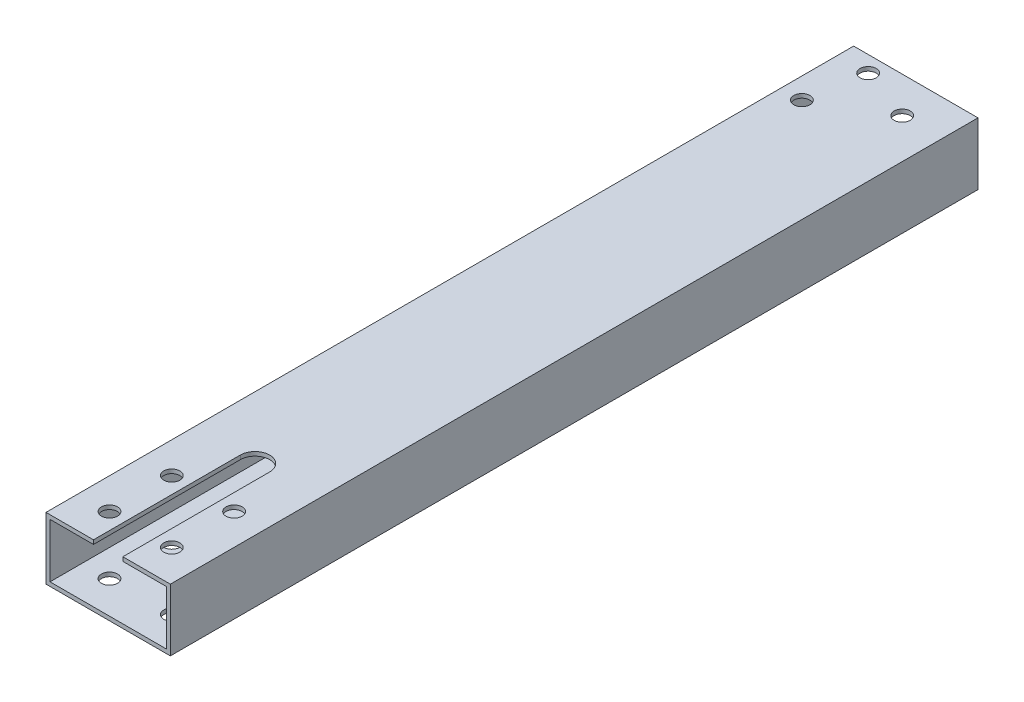
ISO-10303-21;
HEADER;
FILE_DESCRIPTION(('STEP AP214'),'2;1');
FILE_NAME('part.step','',(''),(''),'','','');
FILE_SCHEMA(('AUTOMOTIVE_DESIGN { 1 0 10303 214 1 1 1 1 }'));
ENDSEC;
DATA;
#1=APPLICATION_CONTEXT('core data for automotive mechanical design processes');
#2=APPLICATION_PROTOCOL_DEFINITION('international standard','automotive_design',2000,#1);
#3=PRODUCT_CONTEXT('',#1,'mechanical');
#4=PRODUCT('Part','Part','',(#3));
#5=PRODUCT_RELATED_PRODUCT_CATEGORY('part','',(#4));
#6=PRODUCT_DEFINITION_FORMATION('','',#4);
#7=PRODUCT_DEFINITION_CONTEXT('part definition',#1,'design');
#8=PRODUCT_DEFINITION('design','',#6,#7);
#9=PRODUCT_DEFINITION_SHAPE('','',#8);
#10=(LENGTH_UNIT() NAMED_UNIT(*) SI_UNIT(.MILLI.,.METRE.));
#11=(NAMED_UNIT(*) PLANE_ANGLE_UNIT() SI_UNIT($,.RADIAN.));
#12=(NAMED_UNIT(*) SI_UNIT($,.STERADIAN.) SOLID_ANGLE_UNIT());
#13=UNCERTAINTY_MEASURE_WITH_UNIT(LENGTH_MEASURE(1.E-05),#10,'distance_accuracy_value','');
#14=(GEOMETRIC_REPRESENTATION_CONTEXT(3) GLOBAL_UNCERTAINTY_ASSIGNED_CONTEXT((#13)) GLOBAL_UNIT_ASSIGNED_CONTEXT((#10,
#11,#12)) REPRESENTATION_CONTEXT('',''));
#15=CARTESIAN_POINT('',(0.,0.,0.));
#16=DIRECTION('',(0.,0.,1.));
#17=DIRECTION('',(1.,0.,0.));
#18=AXIS2_PLACEMENT_3D('',#15,#16,#17);
#19=CARTESIAN_POINT('',(0.,0.,330.));
#20=DIRECTION('',(0.,0.,1.));
#21=DIRECTION('',(1.,0.,0.));
#22=AXIS2_PLACEMENT_3D('',#19,#20,#21);
#23=PLANE('',#22);
#24=DIRECTION('',(0.,1.,0.));
#25=VECTOR('',#24,1.);
#26=CARTESIAN_POINT('',(-5.99999999999999,-12.701,330.));
#27=LINE('',#26,#25);
#28=CARTESIAN_POINT('',(-5.99999999999999,11.049,330.));
#29=VERTEX_POINT('',#28);
#30=CARTESIAN_POINT('',(-5.99999999999999,12.7,330.));
#31=VERTEX_POINT('',#30);
#32=EDGE_CURVE('E152',#29,#31,#27,.T.);
#33=ORIENTED_EDGE('',*,*,#32,.T.);
#34=DIRECTION('',(-1.,0.,0.));
#35=VECTOR('',#34,1.);
#36=CARTESIAN_POINT('',(-25.4,12.7,330.));
#37=LINE('',#36,#35);
#38=CARTESIAN_POINT('',(-25.4,12.7,330.));
#39=VERTEX_POINT('',#38);
#40=EDGE_CURVE('E194',#31,#39,#37,.T.);
#41=ORIENTED_EDGE('',*,*,#40,.T.);
#42=DIRECTION('',(0.,-1.,0.));
#43=VECTOR('',#42,1.);
#44=CARTESIAN_POINT('',(-25.4,12.7,330.));
#45=LINE('',#44,#43);
#46=CARTESIAN_POINT('',(-25.4,-12.7,330.));
#47=VERTEX_POINT('',#46);
#48=EDGE_CURVE('E186',#39,#47,#45,.T.);
#49=ORIENTED_EDGE('',*,*,#48,.T.);
#50=DIRECTION('',(1.,0.,0.));
#51=VECTOR('',#50,1.);
#52=CARTESIAN_POINT('',(-25.4,-12.7,330.));
#53=LINE('',#52,#51);
#54=CARTESIAN_POINT('',(25.4,-12.7,330.));
#55=VERTEX_POINT('',#54);
#56=EDGE_CURVE('E189',#47,#55,#53,.T.);
#57=ORIENTED_EDGE('',*,*,#56,.T.);
#58=DIRECTION('',(0.,1.,0.));
#59=VECTOR('',#58,1.);
#60=CARTESIAN_POINT('',(25.4,12.7,330.));
#61=LINE('',#60,#59);
#62=CARTESIAN_POINT('',(25.4,12.7,330.));
#63=VERTEX_POINT('',#62);
#64=EDGE_CURVE('E192',#55,#63,#61,.T.);
#65=ORIENTED_EDGE('',*,*,#64,.T.);
#66=CARTESIAN_POINT('',(6.00000000000001,12.7,330.));
#67=VERTEX_POINT('',#66);
#68=EDGE_CURVE('E151',#63,#67,#37,.T.);
#69=ORIENTED_EDGE('',*,*,#68,.T.);
#70=DIRECTION('',(0.,1.,0.));
#71=VECTOR('',#70,1.);
#72=CARTESIAN_POINT('',(6.00000000000001,-12.701,330.));
#73=LINE('',#72,#71);
#74=CARTESIAN_POINT('',(6.00000000000001,11.049,330.));
#75=VERTEX_POINT('',#74);
#76=EDGE_CURVE('E137',#75,#67,#73,.T.);
#77=ORIENTED_EDGE('',*,*,#76,.F.);
#78=DIRECTION('',(-1.,0.,0.));
#79=VECTOR('',#78,1.);
#80=CARTESIAN_POINT('',(-23.749,11.049,330.));
#81=LINE('',#80,#79);
#82=CARTESIAN_POINT('',(23.749,11.049,330.));
#83=VERTEX_POINT('',#82);
#84=EDGE_CURVE('E149',#83,#75,#81,.T.);
#85=ORIENTED_EDGE('',*,*,#84,.F.);
#86=DIRECTION('',(0.,1.,0.));
#87=VECTOR('',#86,1.);
#88=CARTESIAN_POINT('',(23.749,11.049,330.));
#89=LINE('',#88,#87);
#90=CARTESIAN_POINT('',(23.749,-11.049,330.));
#91=VERTEX_POINT('',#90);
#92=EDGE_CURVE('E161',#91,#83,#89,.T.);
#93=ORIENTED_EDGE('',*,*,#92,.F.);
#94=DIRECTION('',(1.,0.,0.));
#95=VECTOR('',#94,1.);
#96=CARTESIAN_POINT('',(-23.749,-11.049,330.));
#97=LINE('',#96,#95);
#98=CARTESIAN_POINT('',(-23.749,-11.049,330.));
#99=VERTEX_POINT('',#98);
#100=EDGE_CURVE('E301',#99,#91,#97,.T.);
#101=ORIENTED_EDGE('',*,*,#100,.F.);
#102=DIRECTION('',(0.,-1.,0.));
#103=VECTOR('',#102,1.);
#104=CARTESIAN_POINT('',(-23.749,11.049,330.));
#105=LINE('',#104,#103);
#106=CARTESIAN_POINT('',(-23.749,11.049,330.));
#107=VERTEX_POINT('',#106);
#108=EDGE_CURVE('E177',#107,#99,#105,.T.);
#109=ORIENTED_EDGE('',*,*,#108,.F.);
#110=EDGE_CURVE('E157',#29,#107,#81,.T.);
#111=ORIENTED_EDGE('',*,*,#110,.F.);
#112=EDGE_LOOP('',(#33,#41,#49,#57,#65,#69,#77,#85,#93,#101,#109,#111));
#113=FACE_BOUND('',#112,.T.);
#114=ADVANCED_FACE('F41',(#113),#23,.T.);
#115=CARTESIAN_POINT('',(0.,0.,0.));
#116=DIRECTION('',(0.,0.,1.));
#117=DIRECTION('',(1.,0.,0.));
#118=AXIS2_PLACEMENT_3D('',#115,#116,#117);
#119=PLANE('',#118);
#120=DIRECTION('',(0.,-1.,0.));
#121=VECTOR('',#120,1.);
#122=CARTESIAN_POINT('',(-25.4,12.7,0.));
#123=LINE('',#122,#121);
#124=CARTESIAN_POINT('',(-25.4,12.7,0.));
#125=VERTEX_POINT('',#124);
#126=CARTESIAN_POINT('',(-25.4,-12.7,0.));
#127=VERTEX_POINT('',#126);
#128=EDGE_CURVE('E185',#125,#127,#123,.T.);
#129=ORIENTED_EDGE('',*,*,#128,.F.);
#130=DIRECTION('',(-1.,0.,0.));
#131=VECTOR('',#130,1.);
#132=CARTESIAN_POINT('',(-25.4,12.7,0.));
#133=LINE('',#132,#131);
#134=CARTESIAN_POINT('',(25.4,12.7,0.));
#135=VERTEX_POINT('',#134);
#136=EDGE_CURVE('E190',#135,#125,#133,.T.);
#137=ORIENTED_EDGE('',*,*,#136,.F.);
#138=DIRECTION('',(0.,1.,0.));
#139=VECTOR('',#138,1.);
#140=CARTESIAN_POINT('',(25.4,12.7,0.));
#141=LINE('',#140,#139);
#142=CARTESIAN_POINT('',(25.4,-12.7,0.));
#143=VERTEX_POINT('',#142);
#144=EDGE_CURVE('E201',#143,#135,#141,.T.);
#145=ORIENTED_EDGE('',*,*,#144,.F.);
#146=DIRECTION('',(1.,0.,0.));
#147=VECTOR('',#146,1.);
#148=CARTESIAN_POINT('',(-25.4,-12.7,0.));
#149=LINE('',#148,#147);
#150=EDGE_CURVE('E199',#127,#143,#149,.T.);
#151=ORIENTED_EDGE('',*,*,#150,.F.);
#152=EDGE_LOOP('',(#129,#137,#145,#151));
#153=FACE_BOUND('',#152,.T.);
#154=DIRECTION('',(0.,-1.,0.));
#155=VECTOR('',#154,1.);
#156=CARTESIAN_POINT('',(-23.749,11.049,0.));
#157=LINE('',#156,#155);
#158=CARTESIAN_POINT('',(-23.749,11.049,0.));
#159=VERTEX_POINT('',#158);
#160=CARTESIAN_POINT('',(-23.749,-11.049,0.));
#161=VERTEX_POINT('',#160);
#162=EDGE_CURVE('E165',#159,#161,#157,.T.);
#163=ORIENTED_EDGE('',*,*,#162,.T.);
#164=DIRECTION('',(1.,0.,0.));
#165=VECTOR('',#164,1.);
#166=CARTESIAN_POINT('',(-23.749,-11.049,0.));
#167=LINE('',#166,#165);
#168=CARTESIAN_POINT('',(23.749,-11.049,0.));
#169=VERTEX_POINT('',#168);
#170=EDGE_CURVE('E168',#161,#169,#167,.T.);
#171=ORIENTED_EDGE('',*,*,#170,.T.);
#172=DIRECTION('',(0.,1.,0.));
#173=VECTOR('',#172,1.);
#174=CARTESIAN_POINT('',(23.749,11.049,0.));
#175=LINE('',#174,#173);
#176=CARTESIAN_POINT('',(23.749,11.049,0.));
#177=VERTEX_POINT('',#176);
#178=EDGE_CURVE('E172',#169,#177,#175,.T.);
#179=ORIENTED_EDGE('',*,*,#178,.T.);
#180=DIRECTION('',(-1.,0.,0.));
#181=VECTOR('',#180,1.);
#182=CARTESIAN_POINT('',(-23.749,11.049,0.));
#183=LINE('',#182,#181);
#184=EDGE_CURVE('E175',#177,#159,#183,.T.);
#185=ORIENTED_EDGE('',*,*,#184,.T.);
#186=EDGE_LOOP('',(#163,#171,#179,#185));
#187=FACE_BOUND('',#186,.T.);
#188=ADVANCED_FACE('F316',(#153,#187),#119,.F.);
#189=CARTESIAN_POINT('',(-25.4,12.7,330.));
#190=DIRECTION('',(1.,0.,0.));
#191=DIRECTION('',(0.,0.,-1.));
#192=AXIS2_PLACEMENT_3D('',#189,#190,#191);
#193=PLANE('',#192);
#194=ORIENTED_EDGE('',*,*,#128,.T.);
#195=DIRECTION('',(0.,0.,-1.));
#196=VECTOR('',#195,1.);
#197=CARTESIAN_POINT('',(-25.4,-12.7,330.));
#198=LINE('',#197,#196);
#199=EDGE_CURVE('E11',#47,#127,#198,.T.);
#200=ORIENTED_EDGE('',*,*,#199,.F.);
#201=ORIENTED_EDGE('',*,*,#48,.F.);
#202=DIRECTION('',(0.,0.,-1.));
#203=VECTOR('',#202,1.);
#204=CARTESIAN_POINT('',(-25.4,12.7,330.));
#205=LINE('',#204,#203);
#206=EDGE_CURVE('E196',#39,#125,#205,.T.);
#207=ORIENTED_EDGE('',*,*,#206,.T.);
#208=EDGE_LOOP('',(#194,#200,#201,#207));
#209=FACE_BOUND('',#208,.T.);
#210=ADVANCED_FACE('F43',(#209),#193,.F.);
#211=CARTESIAN_POINT('',(-25.4,-12.7,330.));
#212=DIRECTION('',(0.,1.,0.));
#213=DIRECTION('',(-1.,0.,0.));
#214=AXIS2_PLACEMENT_3D('',#211,#212,#213);
#215=PLANE('',#214);
#216=CARTESIAN_POINT('',(-12.85944875819,-12.7,6.61611582530557));
#217=DIRECTION('',(0.,1.,0.));
#218=DIRECTION('',(0.,0.,1.));
#219=AXIS2_PLACEMENT_3D('',#216,#217,#218);
#220=CIRCLE('',#219,3.30000000399998);
#221=CARTESIAN_POINT('',(-12.85944875819,-12.7,9.91611582930555));
#222=VERTEX_POINT('',#221);
#223=EDGE_CURVE('E377',#222,#222,#220,.T.);
#224=ORIENTED_EDGE('',*,*,#223,.T.);
#225=EDGE_LOOP('',(#224));
#226=FACE_BOUND('',#225,.T.);
#227=CARTESIAN_POINT('',(9.13093229857653,-12.7,14.7045730934255));
#228=DIRECTION('',(0.,1.,0.));
#229=DIRECTION('',(0.,0.,1.));
#230=AXIS2_PLACEMENT_3D('',#227,#228,#229);
#231=CIRCLE('',#230,3.30000000399998);
#232=CARTESIAN_POINT('',(9.13093229857653,-12.7,18.0045730974255));
#233=VERTEX_POINT('',#232);
#234=EDGE_CURVE('E235',#233,#233,#231,.T.);
#235=ORIENTED_EDGE('',*,*,#234,.T.);
#236=EDGE_LOOP('',(#235));
#237=FACE_BOUND('',#236,.T.);
#238=CARTESIAN_POINT('',(-16.8498298149566,-12.7,29.7045730934255));
#239=DIRECTION('',(0.,1.,0.));
#240=DIRECTION('',(0.,0.,1.));
#241=AXIS2_PLACEMENT_3D('',#238,#239,#240);
#242=CIRCLE('',#241,3.30000000399998);
#243=CARTESIAN_POINT('',(-16.8498298149566,-12.7,33.0045730974254));
#244=VERTEX_POINT('',#243);
#245=EDGE_CURVE('E231',#244,#244,#242,.T.);
#246=ORIENTED_EDGE('',*,*,#245,.T.);
#247=EDGE_LOOP('',(#246));
#248=FACE_BOUND('',#247,.T.);
#249=CARTESIAN_POINT('',(12.7279220613578,-12.7,316.727922061358));
#250=DIRECTION('',(0.,1.,0.));
#251=DIRECTION('',(0.,0.,1.));
#252=AXIS2_PLACEMENT_3D('',#249,#250,#251);
#253=CIRCLE('',#252,3.30000000000001);
#254=CARTESIAN_POINT('',(12.7279220613578,-12.7,320.027922061358));
#255=VERTEX_POINT('',#254);
#256=EDGE_CURVE('E260',#255,#255,#253,.T.);
#257=ORIENTED_EDGE('',*,*,#256,.T.);
#258=EDGE_LOOP('',(#257));
#259=FACE_BOUND('',#258,.T.);
#260=CARTESIAN_POINT('',(12.7279220613579,-12.7,291.272077938642));
#261=DIRECTION('',(0.,1.,0.));
#262=DIRECTION('',(0.,0.,1.));
#263=AXIS2_PLACEMENT_3D('',#260,#261,#262);
#264=CIRCLE('',#263,3.30000000000001);
#265=CARTESIAN_POINT('',(12.7279220613579,-12.7,294.572077938642));
#266=VERTEX_POINT('',#265);
#267=EDGE_CURVE('E271',#266,#266,#264,.T.);
#268=ORIENTED_EDGE('',*,*,#267,.T.);
#269=EDGE_LOOP('',(#268));
#270=FACE_BOUND('',#269,.T.);
#271=CARTESIAN_POINT('',(-12.7279220613578,-12.7,291.272077938642));
#272=DIRECTION('',(0.,1.,0.));
#273=DIRECTION('',(0.,0.,1.));
#274=AXIS2_PLACEMENT_3D('',#271,#272,#273);
#275=CIRCLE('',#274,3.30000000000001);
#276=CARTESIAN_POINT('',(-12.7279220613578,-12.7,294.572077938642));
#277=VERTEX_POINT('',#276);
#278=EDGE_CURVE('E265',#277,#277,#275,.T.);
#279=ORIENTED_EDGE('',*,*,#278,.T.);
#280=EDGE_LOOP('',(#279));
#281=FACE_BOUND('',#280,.T.);
#282=CARTESIAN_POINT('',(-12.7279220613579,-12.7,316.727922061358));
#283=DIRECTION('',(0.,1.,0.));
#284=DIRECTION('',(0.,0.,1.));
#285=AXIS2_PLACEMENT_3D('',#282,#283,#284);
#286=CIRCLE('',#285,3.29999999999996);
#287=CARTESIAN_POINT('',(-12.7279220613579,-12.7,320.027922061358));
#288=VERTEX_POINT('',#287);
#289=EDGE_CURVE('E215',#288,#288,#286,.T.);
#290=ORIENTED_EDGE('',*,*,#289,.T.);
#291=EDGE_LOOP('',(#290));
#292=FACE_BOUND('',#291,.T.);
#293=ORIENTED_EDGE('',*,*,#150,.T.);
#294=DIRECTION('',(0.,0.,-1.));
#295=VECTOR('',#294,1.);
#296=CARTESIAN_POINT('',(25.4,-12.7,330.));
#297=LINE('',#296,#295);
#298=EDGE_CURVE('E50',#55,#143,#297,.T.);
#299=ORIENTED_EDGE('',*,*,#298,.F.);
#300=ORIENTED_EDGE('',*,*,#56,.F.);
#301=ORIENTED_EDGE('',*,*,#199,.T.);
#302=EDGE_LOOP('',(#293,#299,#300,#301));
#303=FACE_BOUND('',#302,.T.);
#304=ADVANCED_FACE('F334',(#226,#237,#248,#259,#270,#281,#292,#303),#215,.F.);
#305=CARTESIAN_POINT('',(25.4,12.7,330.));
#306=DIRECTION('',(-1.,0.,0.));
#307=DIRECTION('',(0.,0.,1.));
#308=AXIS2_PLACEMENT_3D('',#305,#306,#307);
#309=PLANE('',#308);
#310=ORIENTED_EDGE('',*,*,#144,.T.);
#311=DIRECTION('',(0.,0.,-1.));
#312=VECTOR('',#311,1.);
#313=CARTESIAN_POINT('',(25.4,12.7,330.));
#314=LINE('',#313,#312);
#315=EDGE_CURVE('E206',#63,#135,#314,.T.);
#316=ORIENTED_EDGE('',*,*,#315,.F.);
#317=ORIENTED_EDGE('',*,*,#64,.F.);
#318=ORIENTED_EDGE('',*,*,#298,.T.);
#319=EDGE_LOOP('',(#310,#316,#317,#318));
#320=FACE_BOUND('',#319,.T.);
#321=ADVANCED_FACE('F337',(#320),#309,.F.);
#322=CARTESIAN_POINT('',(-25.4,12.7,330.));
#323=DIRECTION('',(0.,-1.,0.));
#324=DIRECTION('',(1.,0.,0.));
#325=AXIS2_PLACEMENT_3D('',#322,#323,#324);
#326=PLANE('',#325);
#327=CARTESIAN_POINT('',(-12.85944875819,12.7,6.61611582530557));
#328=DIRECTION('',(0.,-1.,0.));
#329=DIRECTION('',(1.,0.,0.));
#330=AXIS2_PLACEMENT_3D('',#327,#328,#329);
#331=CIRCLE('',#330,3.30000000399999);
#332=CARTESIAN_POINT('',(-9.55944875419002,12.7,6.61611582530557));
#333=VERTEX_POINT('',#332);
#334=EDGE_CURVE('E242',#333,#333,#331,.T.);
#335=ORIENTED_EDGE('',*,*,#334,.T.);
#336=EDGE_LOOP('',(#335));
#337=FACE_BOUND('',#336,.T.);
#338=CARTESIAN_POINT('',(9.13093229857653,12.7,14.7045730934255));
#339=DIRECTION('',(0.,-1.,0.));
#340=DIRECTION('',(1.,0.,0.));
#341=AXIS2_PLACEMENT_3D('',#338,#339,#340);
#342=CIRCLE('',#341,3.30000000399999);
#343=CARTESIAN_POINT('',(12.4309323025765,12.7,14.7045730934255));
#344=VERTEX_POINT('',#343);
#345=EDGE_CURVE('E239',#344,#344,#342,.T.);
#346=ORIENTED_EDGE('',*,*,#345,.T.);
#347=EDGE_LOOP('',(#346));
#348=FACE_BOUND('',#347,.T.);
#349=CARTESIAN_POINT('',(-16.8498298149566,12.7,29.7045730934255));
#350=DIRECTION('',(0.,-1.,0.));
#351=DIRECTION('',(1.,0.,0.));
#352=AXIS2_PLACEMENT_3D('',#349,#350,#351);
#353=CIRCLE('',#352,3.30000000399999);
#354=CARTESIAN_POINT('',(-13.5498298109567,12.7,29.7045730934255));
#355=VERTEX_POINT('',#354);
#356=EDGE_CURVE('E257',#355,#355,#353,.T.);
#357=ORIENTED_EDGE('',*,*,#356,.T.);
#358=EDGE_LOOP('',(#357));
#359=FACE_BOUND('',#358,.T.);
#360=CARTESIAN_POINT('',(12.7279220613578,12.7,316.727922061358));
#361=DIRECTION('',(0.,1.,0.));
#362=DIRECTION('',(0.,0.,1.));
#363=AXIS2_PLACEMENT_3D('',#360,#361,#362);
#364=CIRCLE('',#363,3.30000000000001);
#365=CARTESIAN_POINT('',(12.7279220613578,12.7,320.027922061358));
#366=VERTEX_POINT('',#365);
#367=EDGE_CURVE('E274',#366,#366,#364,.T.);
#368=ORIENTED_EDGE('',*,*,#367,.F.);
#369=EDGE_LOOP('',(#368));
#370=FACE_BOUND('',#369,.T.);
#371=CARTESIAN_POINT('',(12.7279220613579,12.7,291.272077938642));
#372=DIRECTION('',(0.,1.,0.));
#373=DIRECTION('',(0.,0.,1.));
#374=AXIS2_PLACEMENT_3D('',#371,#372,#373);
#375=CIRCLE('',#374,3.30000000000001);
#376=CARTESIAN_POINT('',(12.7279220613579,12.7,294.572077938642));
#377=VERTEX_POINT('',#376);
#378=EDGE_CURVE('E268',#377,#377,#375,.T.);
#379=ORIENTED_EDGE('',*,*,#378,.F.);
#380=EDGE_LOOP('',(#379));
#381=FACE_BOUND('',#380,.T.);
#382=CARTESIAN_POINT('',(-12.7279220613578,12.7,291.272077938642));
#383=DIRECTION('',(0.,1.,0.));
#384=DIRECTION('',(0.,0.,1.));
#385=AXIS2_PLACEMENT_3D('',#382,#383,#384);
#386=CIRCLE('',#385,3.30000000000001);
#387=CARTESIAN_POINT('',(-12.7279220613578,12.7,294.572077938642));
#388=VERTEX_POINT('',#387);
#389=EDGE_CURVE('E261',#388,#388,#386,.T.);
#390=ORIENTED_EDGE('',*,*,#389,.F.);
#391=EDGE_LOOP('',(#390));
#392=FACE_BOUND('',#391,.T.);
#393=CARTESIAN_POINT('',(-12.7279220613579,12.7,316.727922061358));
#394=DIRECTION('',(0.,1.,0.));
#395=DIRECTION('',(0.,0.,1.));
#396=AXIS2_PLACEMENT_3D('',#393,#394,#395);
#397=CIRCLE('',#396,3.29999999999996);
#398=CARTESIAN_POINT('',(-12.7279220613579,12.7,320.027922061358));
#399=VERTEX_POINT('',#398);
#400=EDGE_CURVE('E264',#399,#399,#397,.T.);
#401=ORIENTED_EDGE('',*,*,#400,.F.);
#402=EDGE_LOOP('',(#401));
#403=FACE_BOUND('',#402,.T.);
#404=ORIENTED_EDGE('',*,*,#40,.F.);
#405=DIRECTION('',(0.,0.,1.));
#406=VECTOR('',#405,1.);
#407=CARTESIAN_POINT('',(-6.,12.7,270.));
#408=LINE('',#407,#406);
#409=CARTESIAN_POINT('',(-6.,12.7,270.));
#410=VERTEX_POINT('',#409);
#411=EDGE_CURVE('E293',#410,#31,#408,.T.);
#412=ORIENTED_EDGE('',*,*,#411,.F.);
#413=CARTESIAN_POINT('',(0.,12.7,270.));
#414=DIRECTION('',(0.,1.,0.));
#415=DIRECTION('',(0.,0.,1.));
#416=AXIS2_PLACEMENT_3D('',#413,#414,#415);
#417=CIRCLE('',#416,6.);
#418=CARTESIAN_POINT('',(6.,12.7,270.));
#419=VERTEX_POINT('',#418);
#420=EDGE_CURVE('E141',#419,#410,#417,.T.);
#421=ORIENTED_EDGE('',*,*,#420,.F.);
#422=DIRECTION('',(0.,0.,-1.));
#423=VECTOR('',#422,1.);
#424=CARTESIAN_POINT('',(6.,12.7,270.));
#425=LINE('',#424,#423);
#426=EDGE_CURVE('E295',#67,#419,#425,.T.);
#427=ORIENTED_EDGE('',*,*,#426,.F.);
#428=ORIENTED_EDGE('',*,*,#68,.F.);
#429=ORIENTED_EDGE('',*,*,#315,.T.);
#430=ORIENTED_EDGE('',*,*,#136,.T.);
#431=ORIENTED_EDGE('',*,*,#206,.F.);
#432=EDGE_LOOP('',(#404,#412,#421,#427,#428,#429,#430,#431));
#433=FACE_BOUND('',#432,.T.);
#434=ADVANCED_FACE('F323',(#337,#348,#359,#370,#381,#392,#403,#433),#326,.F.);
#435=CARTESIAN_POINT('',(-23.749,11.049,330.));
#436=DIRECTION('',(1.,0.,0.));
#437=DIRECTION('',(0.,1.,0.));
#438=AXIS2_PLACEMENT_3D('',#435,#436,#437);
#439=PLANE('',#438);
#440=ORIENTED_EDGE('',*,*,#162,.F.);
#441=DIRECTION('',(0.,0.,-1.));
#442=VECTOR('',#441,1.);
#443=CARTESIAN_POINT('',(-23.749,11.049,330.));
#444=LINE('',#443,#442);
#445=EDGE_CURVE('E156',#107,#159,#444,.T.);
#446=ORIENTED_EDGE('',*,*,#445,.F.);
#447=ORIENTED_EDGE('',*,*,#108,.T.);
#448=DIRECTION('',(0.,0.,-1.));
#449=VECTOR('',#448,1.);
#450=CARTESIAN_POINT('',(-23.749,-11.049,330.));
#451=LINE('',#450,#449);
#452=EDGE_CURVE('E182',#99,#161,#451,.T.);
#453=ORIENTED_EDGE('',*,*,#452,.T.);
#454=EDGE_LOOP('',(#440,#446,#447,#453));
#455=FACE_BOUND('',#454,.T.);
#456=ADVANCED_FACE('F313',(#455),#439,.T.);
#457=CARTESIAN_POINT('',(-23.749,-11.049,330.));
#458=DIRECTION('',(0.,1.,0.));
#459=DIRECTION('',(0.,0.,1.));
#460=AXIS2_PLACEMENT_3D('',#457,#458,#459);
#461=PLANE('',#460);
#462=CARTESIAN_POINT('',(-12.85944875819,-11.049,6.61611582530557));
#463=DIRECTION('',(0.,1.,0.));
#464=DIRECTION('',(0.,0.,1.));
#465=AXIS2_PLACEMENT_3D('',#462,#463,#464);
#466=CIRCLE('',#465,3.30000000399999);
#467=CARTESIAN_POINT('',(-12.85944875819,-11.049,9.91611582930555));
#468=VERTEX_POINT('',#467);
#469=EDGE_CURVE('E247',#468,#468,#466,.T.);
#470=ORIENTED_EDGE('',*,*,#469,.F.);
#471=EDGE_LOOP('',(#470));
#472=FACE_BOUND('',#471,.T.);
#473=CARTESIAN_POINT('',(9.13093229857653,-11.049,14.7045730934255));
#474=DIRECTION('',(0.,1.,0.));
#475=DIRECTION('',(0.,0.,1.));
#476=AXIS2_PLACEMENT_3D('',#473,#474,#475);
#477=CIRCLE('',#476,3.30000000399999);
#478=CARTESIAN_POINT('',(9.13093229857653,-11.049,18.0045730974255));
#479=VERTEX_POINT('',#478);
#480=EDGE_CURVE('E234',#479,#479,#477,.T.);
#481=ORIENTED_EDGE('',*,*,#480,.F.);
#482=EDGE_LOOP('',(#481));
#483=FACE_BOUND('',#482,.T.);
#484=CARTESIAN_POINT('',(-16.8498298149566,-11.049,29.7045730934255));
#485=DIRECTION('',(0.,1.,0.));
#486=DIRECTION('',(0.,0.,1.));
#487=AXIS2_PLACEMENT_3D('',#484,#485,#486);
#488=CIRCLE('',#487,3.30000000399999);
#489=CARTESIAN_POINT('',(-16.8498298149566,-11.049,33.0045730974254));
#490=VERTEX_POINT('',#489);
#491=EDGE_CURVE('E230',#490,#490,#488,.T.);
#492=ORIENTED_EDGE('',*,*,#491,.F.);
#493=EDGE_LOOP('',(#492));
#494=FACE_BOUND('',#493,.T.);
#495=CARTESIAN_POINT('',(12.7279220613578,-11.049,316.727922061358));
#496=DIRECTION('',(0.,1.,0.));
#497=DIRECTION('',(0.,0.,1.));
#498=AXIS2_PLACEMENT_3D('',#495,#496,#497);
#499=CIRCLE('',#498,3.30000000000001);
#500=CARTESIAN_POINT('',(12.7279220613578,-11.049,320.027922061358));
#501=VERTEX_POINT('',#500);
#502=EDGE_CURVE('E227',#501,#501,#499,.T.);
#503=ORIENTED_EDGE('',*,*,#502,.F.);
#504=EDGE_LOOP('',(#503));
#505=FACE_BOUND('',#504,.T.);
#506=CARTESIAN_POINT('',(12.7279220613579,-11.049,291.272077938642));
#507=DIRECTION('',(0.,1.,0.));
#508=DIRECTION('',(0.,0.,1.));
#509=AXIS2_PLACEMENT_3D('',#506,#507,#508);
#510=CIRCLE('',#509,3.30000000000001);
#511=CARTESIAN_POINT('',(12.7279220613579,-11.049,294.572077938642));
#512=VERTEX_POINT('',#511);
#513=EDGE_CURVE('E223',#512,#512,#510,.T.);
#514=ORIENTED_EDGE('',*,*,#513,.F.);
#515=EDGE_LOOP('',(#514));
#516=FACE_BOUND('',#515,.T.);
#517=CARTESIAN_POINT('',(-12.7279220613578,-11.049,291.272077938642));
#518=DIRECTION('',(0.,1.,0.));
#519=DIRECTION('',(0.,0.,1.));
#520=AXIS2_PLACEMENT_3D('',#517,#518,#519);
#521=CIRCLE('',#520,3.30000000000001);
#522=CARTESIAN_POINT('',(-12.7279220613578,-11.049,294.572077938642));
#523=VERTEX_POINT('',#522);
#524=EDGE_CURVE('E219',#523,#523,#521,.T.);
#525=ORIENTED_EDGE('',*,*,#524,.F.);
#526=EDGE_LOOP('',(#525));
#527=FACE_BOUND('',#526,.T.);
#528=CARTESIAN_POINT('',(-12.7279220613579,-11.049,316.727922061358));
#529=DIRECTION('',(0.,1.,0.));
#530=DIRECTION('',(0.,0.,1.));
#531=AXIS2_PLACEMENT_3D('',#528,#529,#530);
#532=CIRCLE('',#531,3.29999999999996);
#533=CARTESIAN_POINT('',(-12.7279220613579,-11.049,320.027922061358));
#534=VERTEX_POINT('',#533);
#535=EDGE_CURVE('E214',#534,#534,#532,.T.);
#536=ORIENTED_EDGE('',*,*,#535,.F.);
#537=EDGE_LOOP('',(#536));
#538=FACE_BOUND('',#537,.T.);
#539=ORIENTED_EDGE('',*,*,#170,.F.);
#540=ORIENTED_EDGE('',*,*,#452,.F.);
#541=ORIENTED_EDGE('',*,*,#100,.T.);
#542=DIRECTION('',(0.,0.,-1.));
#543=VECTOR('',#542,1.);
#544=CARTESIAN_POINT('',(23.749,-11.049,330.));
#545=LINE('',#544,#543);
#546=EDGE_CURVE('E180',#91,#169,#545,.T.);
#547=ORIENTED_EDGE('',*,*,#546,.T.);
#548=EDGE_LOOP('',(#539,#540,#541,#547));
#549=FACE_BOUND('',#548,.T.);
#550=ADVANCED_FACE('F314',(#472,#483,#494,#505,#516,#527,#538,#549),#461,.T.);
#551=CARTESIAN_POINT('',(23.749,11.049,330.));
#552=DIRECTION('',(-1.,0.,0.));
#553=DIRECTION('',(0.,0.,1.));
#554=AXIS2_PLACEMENT_3D('',#551,#552,#553);
#555=PLANE('',#554);
#556=ORIENTED_EDGE('',*,*,#178,.F.);
#557=ORIENTED_EDGE('',*,*,#546,.F.);
#558=ORIENTED_EDGE('',*,*,#92,.T.);
#559=DIRECTION('',(0.,0.,-1.));
#560=VECTOR('',#559,1.);
#561=CARTESIAN_POINT('',(23.749,11.049,330.));
#562=LINE('',#561,#560);
#563=EDGE_CURVE('E66',#83,#177,#562,.T.);
#564=ORIENTED_EDGE('',*,*,#563,.T.);
#565=EDGE_LOOP('',(#556,#557,#558,#564));
#566=FACE_BOUND('',#565,.T.);
#567=ADVANCED_FACE('F308',(#566),#555,.T.);
#568=CARTESIAN_POINT('',(-23.749,11.049,330.));
#569=DIRECTION('',(0.,-1.,0.));
#570=DIRECTION('',(0.,0.,-1.));
#571=AXIS2_PLACEMENT_3D('',#568,#569,#570);
#572=PLANE('',#571);
#573=CARTESIAN_POINT('',(-12.85944875819,11.049,6.61611582530557));
#574=DIRECTION('',(0.,-1.,0.));
#575=DIRECTION('',(0.,0.,-1.));
#576=AXIS2_PLACEMENT_3D('',#573,#574,#575);
#577=CIRCLE('',#576,3.30000000399999);
#578=CARTESIAN_POINT('',(-12.85944875819,11.049,3.31611582130558));
#579=VERTEX_POINT('',#578);
#580=EDGE_CURVE('E45',#579,#579,#577,.T.);
#581=ORIENTED_EDGE('',*,*,#580,.F.);
#582=EDGE_LOOP('',(#581));
#583=FACE_BOUND('',#582,.T.);
#584=CARTESIAN_POINT('',(9.13093229857653,11.049,14.7045730934255));
#585=DIRECTION('',(0.,-1.,0.));
#586=DIRECTION('',(0.,0.,-1.));
#587=AXIS2_PLACEMENT_3D('',#584,#585,#586);
#588=CIRCLE('',#587,3.30000000399999);
#589=CARTESIAN_POINT('',(9.13093229857653,11.049,11.4045730894255));
#590=VERTEX_POINT('',#589);
#591=EDGE_CURVE('E232',#590,#590,#588,.T.);
#592=ORIENTED_EDGE('',*,*,#591,.F.);
#593=EDGE_LOOP('',(#592));
#594=FACE_BOUND('',#593,.T.);
#595=CARTESIAN_POINT('',(-16.8498298149566,11.049,29.7045730934255));
#596=DIRECTION('',(0.,-1.,0.));
#597=DIRECTION('',(0.,0.,-1.));
#598=AXIS2_PLACEMENT_3D('',#595,#596,#597);
#599=CIRCLE('',#598,3.30000000399999);
#600=CARTESIAN_POINT('',(-16.8498298149566,11.049,26.4045730894255));
#601=VERTEX_POINT('',#600);
#602=EDGE_CURVE('E228',#601,#601,#599,.T.);
#603=ORIENTED_EDGE('',*,*,#602,.F.);
#604=EDGE_LOOP('',(#603));
#605=FACE_BOUND('',#604,.T.);
#606=CARTESIAN_POINT('',(12.7279220613578,11.049,316.727922061358));
#607=DIRECTION('',(0.,-1.,0.));
#608=DIRECTION('',(0.,0.,-1.));
#609=AXIS2_PLACEMENT_3D('',#606,#607,#608);
#610=CIRCLE('',#609,3.30000000000001);
#611=CARTESIAN_POINT('',(12.7279220613578,11.049,313.427922061358));
#612=VERTEX_POINT('',#611);
#613=EDGE_CURVE('E224',#612,#612,#610,.T.);
#614=ORIENTED_EDGE('',*,*,#613,.F.);
#615=EDGE_LOOP('',(#614));
#616=FACE_BOUND('',#615,.T.);
#617=CARTESIAN_POINT('',(12.7279220613579,11.049,291.272077938642));
#618=DIRECTION('',(0.,-1.,0.));
#619=DIRECTION('',(0.,0.,-1.));
#620=AXIS2_PLACEMENT_3D('',#617,#618,#619);
#621=CIRCLE('',#620,3.30000000000001);
#622=CARTESIAN_POINT('',(12.7279220613579,11.049,287.972077938642));
#623=VERTEX_POINT('',#622);
#624=EDGE_CURVE('E220',#623,#623,#621,.T.);
#625=ORIENTED_EDGE('',*,*,#624,.F.);
#626=EDGE_LOOP('',(#625));
#627=FACE_BOUND('',#626,.T.);
#628=CARTESIAN_POINT('',(-12.7279220613578,11.049,291.272077938642));
#629=DIRECTION('',(0.,-1.,0.));
#630=DIRECTION('',(0.,0.,-1.));
#631=AXIS2_PLACEMENT_3D('',#628,#629,#630);
#632=CIRCLE('',#631,3.30000000000001);
#633=CARTESIAN_POINT('',(-12.7279220613578,11.049,287.972077938642));
#634=VERTEX_POINT('',#633);
#635=EDGE_CURVE('E216',#634,#634,#632,.T.);
#636=ORIENTED_EDGE('',*,*,#635,.F.);
#637=EDGE_LOOP('',(#636));
#638=FACE_BOUND('',#637,.T.);
#639=CARTESIAN_POINT('',(-12.7279220613579,11.049,316.727922061358));
#640=DIRECTION('',(0.,-1.,0.));
#641=DIRECTION('',(0.,0.,-1.));
#642=AXIS2_PLACEMENT_3D('',#639,#640,#641);
#643=CIRCLE('',#642,3.29999999999996);
#644=CARTESIAN_POINT('',(-12.7279220613579,11.049,313.427922061358));
#645=VERTEX_POINT('',#644);
#646=EDGE_CURVE('E211',#645,#645,#643,.T.);
#647=ORIENTED_EDGE('',*,*,#646,.F.);
#648=EDGE_LOOP('',(#647));
#649=FACE_BOUND('',#648,.T.);
#650=DIRECTION('',(0.,0.,1.));
#651=VECTOR('',#650,1.);
#652=CARTESIAN_POINT('',(-6.,11.049,270.));
#653=LINE('',#652,#651);
#654=CARTESIAN_POINT('',(-6.,11.049,270.));
#655=VERTEX_POINT('',#654);
#656=EDGE_CURVE('E169',#655,#29,#653,.T.);
#657=ORIENTED_EDGE('',*,*,#656,.T.);
#658=ORIENTED_EDGE('',*,*,#110,.T.);
#659=ORIENTED_EDGE('',*,*,#445,.T.);
#660=ORIENTED_EDGE('',*,*,#184,.F.);
#661=ORIENTED_EDGE('',*,*,#563,.F.);
#662=ORIENTED_EDGE('',*,*,#84,.T.);
#663=DIRECTION('',(0.,0.,-1.));
#664=VECTOR('',#663,1.);
#665=CARTESIAN_POINT('',(6.,11.049,270.));
#666=LINE('',#665,#664);
#667=CARTESIAN_POINT('',(6.,11.049,270.));
#668=VERTEX_POINT('',#667);
#669=EDGE_CURVE('E133',#75,#668,#666,.T.);
#670=ORIENTED_EDGE('',*,*,#669,.T.);
#671=CARTESIAN_POINT('',(0.,11.049,270.));
#672=DIRECTION('',(0.,-1.,0.));
#673=DIRECTION('',(0.,0.,-1.));
#674=AXIS2_PLACEMENT_3D('',#671,#672,#673);
#675=CIRCLE('',#674,6.);
#676=EDGE_CURVE('E142',#668,#655,#675,.F.);
#677=ORIENTED_EDGE('',*,*,#676,.T.);
#678=EDGE_LOOP('',(#657,#658,#659,#660,#661,#662,#670,#677));
#679=FACE_BOUND('',#678,.T.);
#680=ADVANCED_FACE('F155',(#583,#594,#605,#616,#627,#638,#649,#679),#572,.T.);
#681=CARTESIAN_POINT('',(-6.,-12.701,270.));
#682=DIRECTION('',(-1.,0.,0.));
#683=DIRECTION('',(0.,0.,1.));
#684=AXIS2_PLACEMENT_3D('',#681,#682,#683);
#685=PLANE('',#684);
#686=DIRECTION('',(0.,1.,0.));
#687=VECTOR('',#686,1.);
#688=CARTESIAN_POINT('',(-6.,-12.701,270.));
#689=LINE('',#688,#687);
#690=EDGE_CURVE('E58',#655,#410,#689,.T.);
#691=ORIENTED_EDGE('',*,*,#690,.T.);
#692=ORIENTED_EDGE('',*,*,#411,.T.);
#693=ORIENTED_EDGE('',*,*,#32,.F.);
#694=ORIENTED_EDGE('',*,*,#656,.F.);
#695=EDGE_LOOP('',(#691,#692,#693,#694));
#696=FACE_BOUND('',#695,.T.);
#697=ADVANCED_FACE('F318',(#696),#685,.F.);
#698=CARTESIAN_POINT('',(6.,-12.701,270.));
#699=DIRECTION('',(1.,0.,0.));
#700=DIRECTION('',(0.,0.,-1.));
#701=AXIS2_PLACEMENT_3D('',#698,#699,#700);
#702=PLANE('',#701);
#703=ORIENTED_EDGE('',*,*,#76,.T.);
#704=ORIENTED_EDGE('',*,*,#426,.T.);
#705=DIRECTION('',(0.,1.,0.));
#706=VECTOR('',#705,1.);
#707=CARTESIAN_POINT('',(6.,-12.701,270.));
#708=LINE('',#707,#706);
#709=EDGE_CURVE('E139',#668,#419,#708,.T.);
#710=ORIENTED_EDGE('',*,*,#709,.F.);
#711=ORIENTED_EDGE('',*,*,#669,.F.);
#712=EDGE_LOOP('',(#703,#704,#710,#711));
#713=FACE_BOUND('',#712,.T.);
#714=ADVANCED_FACE('F135',(#713),#702,.F.);
#715=CARTESIAN_POINT('',(0.,-12.701,270.));
#716=DIRECTION('',(0.,1.,0.));
#717=DIRECTION('',(0.,0.,1.));
#718=AXIS2_PLACEMENT_3D('',#715,#716,#717);
#719=CYLINDRICAL_SURFACE('',#718,6.);
#720=ORIENTED_EDGE('',*,*,#709,.T.);
#721=ORIENTED_EDGE('',*,*,#420,.T.);
#722=ORIENTED_EDGE('',*,*,#690,.F.);
#723=ORIENTED_EDGE('',*,*,#676,.F.);
#724=EDGE_LOOP('',(#720,#721,#722,#723));
#725=FACE_BOUND('',#724,.T.);
#726=ADVANCED_FACE('F338',(#725),#719,.F.);
#727=CARTESIAN_POINT('',(-12.7279220613579,-12.7,316.727922061358));
#728=DIRECTION('',(0.,1.,0.));
#729=DIRECTION('',(0.,0.,1.));
#730=AXIS2_PLACEMENT_3D('',#727,#728,#729);
#731=CYLINDRICAL_SURFACE('',#730,3.29999999999996);
#732=ORIENTED_EDGE('',*,*,#646,.T.);
#733=EDGE_LOOP('',(#732));
#734=FACE_BOUND('',#733,.T.);
#735=ORIENTED_EDGE('',*,*,#400,.T.);
#736=EDGE_LOOP('',(#735));
#737=FACE_BOUND('',#736,.T.);
#738=ADVANCED_FACE('F340',(#734,#737),#731,.F.);
#739=CARTESIAN_POINT('',(-12.7279220613578,-12.7,291.272077938642));
#740=DIRECTION('',(0.,1.,0.));
#741=DIRECTION('',(0.,0.,1.));
#742=AXIS2_PLACEMENT_3D('',#739,#740,#741);
#743=CYLINDRICAL_SURFACE('',#742,3.30000000000001);
#744=ORIENTED_EDGE('',*,*,#635,.T.);
#745=EDGE_LOOP('',(#744));
#746=FACE_BOUND('',#745,.T.);
#747=ORIENTED_EDGE('',*,*,#389,.T.);
#748=EDGE_LOOP('',(#747));
#749=FACE_BOUND('',#748,.T.);
#750=ADVANCED_FACE('F346',(#746,#749),#743,.F.);
#751=CARTESIAN_POINT('',(12.7279220613579,-12.7,291.272077938642));
#752=DIRECTION('',(0.,1.,0.));
#753=DIRECTION('',(0.,0.,1.));
#754=AXIS2_PLACEMENT_3D('',#751,#752,#753);
#755=CYLINDRICAL_SURFACE('',#754,3.30000000000001);
#756=ORIENTED_EDGE('',*,*,#624,.T.);
#757=EDGE_LOOP('',(#756));
#758=FACE_BOUND('',#757,.T.);
#759=ORIENTED_EDGE('',*,*,#378,.T.);
#760=EDGE_LOOP('',(#759));
#761=FACE_BOUND('',#760,.T.);
#762=ADVANCED_FACE('F400',(#758,#761),#755,.F.);
#763=CARTESIAN_POINT('',(12.7279220613578,-12.7,316.727922061358));
#764=DIRECTION('',(0.,1.,0.));
#765=DIRECTION('',(0.,0.,1.));
#766=AXIS2_PLACEMENT_3D('',#763,#764,#765);
#767=CYLINDRICAL_SURFACE('',#766,3.30000000000001);
#768=ORIENTED_EDGE('',*,*,#613,.T.);
#769=EDGE_LOOP('',(#768));
#770=FACE_BOUND('',#769,.T.);
#771=ORIENTED_EDGE('',*,*,#367,.T.);
#772=EDGE_LOOP('',(#771));
#773=FACE_BOUND('',#772,.T.);
#774=ADVANCED_FACE('F391',(#770,#773),#767,.F.);
#775=ORIENTED_EDGE('',*,*,#535,.T.);
#776=EDGE_LOOP('',(#775));
#777=FACE_BOUND('',#776,.T.);
#778=ORIENTED_EDGE('',*,*,#289,.F.);
#779=EDGE_LOOP('',(#778));
#780=FACE_BOUND('',#779,.T.);
#781=ADVANCED_FACE('F349',(#777,#780),#731,.F.);
#782=ORIENTED_EDGE('',*,*,#524,.T.);
#783=EDGE_LOOP('',(#782));
#784=FACE_BOUND('',#783,.T.);
#785=ORIENTED_EDGE('',*,*,#278,.F.);
#786=EDGE_LOOP('',(#785));
#787=FACE_BOUND('',#786,.T.);
#788=ADVANCED_FACE('F390',(#784,#787),#743,.F.);
#789=ORIENTED_EDGE('',*,*,#513,.T.);
#790=EDGE_LOOP('',(#789));
#791=FACE_BOUND('',#790,.T.);
#792=ORIENTED_EDGE('',*,*,#267,.F.);
#793=EDGE_LOOP('',(#792));
#794=FACE_BOUND('',#793,.T.);
#795=ADVANCED_FACE('F397',(#791,#794),#755,.F.);
#796=ORIENTED_EDGE('',*,*,#502,.T.);
#797=EDGE_LOOP('',(#796));
#798=FACE_BOUND('',#797,.T.);
#799=ORIENTED_EDGE('',*,*,#256,.F.);
#800=EDGE_LOOP('',(#799));
#801=FACE_BOUND('',#800,.T.);
#802=ADVANCED_FACE('F403',(#798,#801),#767,.F.);
#803=CARTESIAN_POINT('',(-16.8498298149566,20.7,29.7045730934255));
#804=DIRECTION('',(0.,1.,0.));
#805=DIRECTION('',(0.,0.,1.));
#806=AXIS2_PLACEMENT_3D('',#803,#804,#805);
#807=CYLINDRICAL_SURFACE('',#806,3.30000000399999);
#808=ORIENTED_EDGE('',*,*,#602,.T.);
#809=EDGE_LOOP('',(#808));
#810=FACE_BOUND('',#809,.T.);
#811=ORIENTED_EDGE('',*,*,#356,.F.);
#812=EDGE_LOOP('',(#811));
#813=FACE_BOUND('',#812,.T.);
#814=ADVANCED_FACE('F440',(#810,#813),#807,.F.);
#815=ORIENTED_EDGE('',*,*,#491,.T.);
#816=EDGE_LOOP('',(#815));
#817=FACE_BOUND('',#816,.T.);
#818=ORIENTED_EDGE('',*,*,#245,.F.);
#819=EDGE_LOOP('',(#818));
#820=FACE_BOUND('',#819,.T.);
#821=ADVANCED_FACE('F467',(#817,#820),#807,.F.);
#822=CARTESIAN_POINT('',(9.13093229857653,20.7,14.7045730934255));
#823=DIRECTION('',(0.,1.,0.));
#824=DIRECTION('',(0.,0.,1.));
#825=AXIS2_PLACEMENT_3D('',#822,#823,#824);
#826=CYLINDRICAL_SURFACE('',#825,3.30000000399999);
#827=ORIENTED_EDGE('',*,*,#591,.T.);
#828=EDGE_LOOP('',(#827));
#829=FACE_BOUND('',#828,.T.);
#830=ORIENTED_EDGE('',*,*,#345,.F.);
#831=EDGE_LOOP('',(#830));
#832=FACE_BOUND('',#831,.T.);
#833=ADVANCED_FACE('F469',(#829,#832),#826,.F.);
#834=ORIENTED_EDGE('',*,*,#480,.T.);
#835=EDGE_LOOP('',(#834));
#836=FACE_BOUND('',#835,.T.);
#837=ORIENTED_EDGE('',*,*,#234,.F.);
#838=EDGE_LOOP('',(#837));
#839=FACE_BOUND('',#838,.T.);
#840=ADVANCED_FACE('F472',(#836,#839),#826,.F.);
#841=CARTESIAN_POINT('',(-12.85944875819,20.7,6.61611582530557));
#842=DIRECTION('',(0.,1.,0.));
#843=DIRECTION('',(0.,0.,1.));
#844=AXIS2_PLACEMENT_3D('',#841,#842,#843);
#845=CYLINDRICAL_SURFACE('',#844,3.30000000399999);
#846=ORIENTED_EDGE('',*,*,#580,.T.);
#847=EDGE_LOOP('',(#846));
#848=FACE_BOUND('',#847,.T.);
#849=ORIENTED_EDGE('',*,*,#334,.F.);
#850=EDGE_LOOP('',(#849));
#851=FACE_BOUND('',#850,.T.);
#852=ADVANCED_FACE('F473',(#848,#851),#845,.F.);
#853=ORIENTED_EDGE('',*,*,#469,.T.);
#854=EDGE_LOOP('',(#853));
#855=FACE_BOUND('',#854,.T.);
#856=ORIENTED_EDGE('',*,*,#223,.F.);
#857=EDGE_LOOP('',(#856));
#858=FACE_BOUND('',#857,.T.);
#859=ADVANCED_FACE('F475',(#855,#858),#845,.F.);
#860=CLOSED_SHELL('',(#114,#188,#210,#304,#321,#434,#456,#550,#567,#680,#697,#714,#726,#738,
#750,#762,#774,#781,#788,#795,#802,#814,#821,#833,#840,#852,#859));
#861=MANIFOLD_SOLID_BREP('B2',#860);
#862=ADVANCED_BREP_SHAPE_REPRESENTATION('',(#18,#861),#14);
#863=SHAPE_DEFINITION_REPRESENTATION(#9,#862);
ENDSEC;
END-ISO-10303-21;
